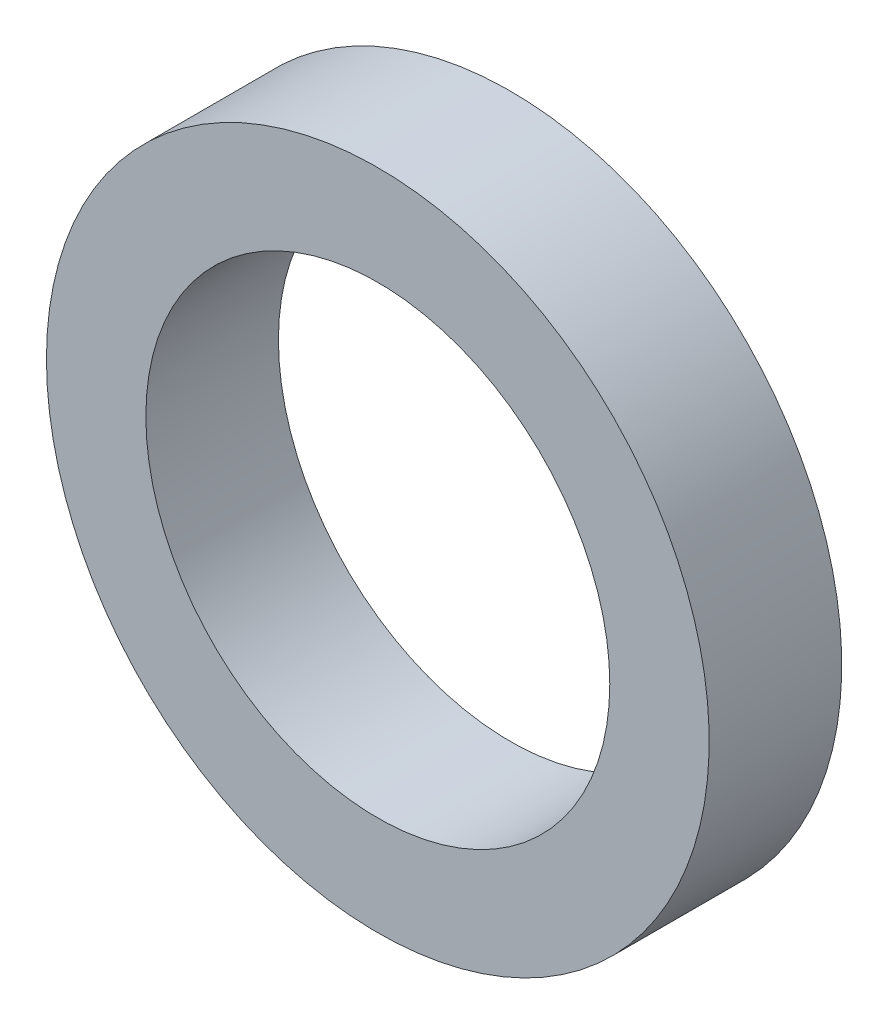
ISO-10303-21;
HEADER;
FILE_DESCRIPTION(('STEP AP214'),'2;1');
FILE_NAME('part.step','',(''),(''),'','','');
FILE_SCHEMA(('AUTOMOTIVE_DESIGN { 1 0 10303 214 1 1 1 1 }'));
ENDSEC;
DATA;
#1=APPLICATION_CONTEXT('core data for automotive mechanical design processes');
#2=APPLICATION_PROTOCOL_DEFINITION('international standard','automotive_design',2000,#1);
#3=PRODUCT_CONTEXT('',#1,'mechanical');
#4=PRODUCT('Part','Part','',(#3));
#5=PRODUCT_RELATED_PRODUCT_CATEGORY('part','',(#4));
#6=PRODUCT_DEFINITION_FORMATION('','',#4);
#7=PRODUCT_DEFINITION_CONTEXT('part definition',#1,'design');
#8=PRODUCT_DEFINITION('design','',#6,#7);
#9=PRODUCT_DEFINITION_SHAPE('','',#8);
#10=(LENGTH_UNIT() NAMED_UNIT(*) SI_UNIT(.MILLI.,.METRE.));
#11=(NAMED_UNIT(*) PLANE_ANGLE_UNIT() SI_UNIT($,.RADIAN.));
#12=(NAMED_UNIT(*) SI_UNIT($,.STERADIAN.) SOLID_ANGLE_UNIT());
#13=UNCERTAINTY_MEASURE_WITH_UNIT(LENGTH_MEASURE(1.E-05),#10,'distance_accuracy_value','');
#14=(GEOMETRIC_REPRESENTATION_CONTEXT(3) GLOBAL_UNCERTAINTY_ASSIGNED_CONTEXT((#13)) GLOBAL_UNIT_ASSIGNED_CONTEXT((#10,
#11,#12)) REPRESENTATION_CONTEXT('',''));
#15=CARTESIAN_POINT('',(0.,0.,0.));
#16=DIRECTION('',(0.,0.,1.));
#17=DIRECTION('',(1.,0.,0.));
#18=AXIS2_PLACEMENT_3D('',#15,#16,#17);
#19=CARTESIAN_POINT('',(0.,0.,1.5875));
#20=DIRECTION('',(0.,0.,-1.));
#21=DIRECTION('',(1.,0.,0.));
#22=AXIS2_PLACEMENT_3D('',#19,#20,#21);
#23=PLANE('',#22);
#24=CARTESIAN_POINT('',(0.,0.,1.5875));
#25=DIRECTION('',(0.,0.,-1.));
#26=DIRECTION('',(-1.,0.,0.));
#27=AXIS2_PLACEMENT_3D('',#24,#25,#26);
#28=CIRCLE('',#27,5.55625);
#29=CARTESIAN_POINT('',(-5.55625,0.,1.5875));
#30=VERTEX_POINT('',#29);
#31=EDGE_CURVE('E47',#30,#30,#28,.F.);
#32=ORIENTED_EDGE('',*,*,#31,.F.);
#33=EDGE_LOOP('',(#32));
#34=FACE_BOUND('',#33,.T.);
#35=CARTESIAN_POINT('',(0.,0.,1.5875));
#36=DIRECTION('',(0.,0.,-1.));
#37=DIRECTION('',(-1.,0.,0.));
#38=AXIS2_PLACEMENT_3D('',#35,#36,#37);
#39=CIRCLE('',#38,7.9375);
#40=CARTESIAN_POINT('',(-7.9375,0.,1.5875));
#41=VERTEX_POINT('',#40);
#42=EDGE_CURVE('E38',#41,#41,#39,.F.);
#43=ORIENTED_EDGE('',*,*,#42,.T.);
#44=EDGE_LOOP('',(#43));
#45=FACE_BOUND('',#44,.T.);
#46=ADVANCED_FACE('F35',(#34,#45),#23,.F.);
#47=CARTESIAN_POINT('',(0.,0.,-1.5875));
#48=DIRECTION('',(0.,0.,1.));
#49=DIRECTION('',(-1.,0.,0.));
#50=AXIS2_PLACEMENT_3D('',#47,#48,#49);
#51=CYLINDRICAL_SURFACE('',#50,7.9375);
#52=ORIENTED_EDGE('',*,*,#42,.F.);
#53=EDGE_LOOP('',(#52));
#54=FACE_BOUND('',#53,.T.);
#55=CARTESIAN_POINT('',(0.,0.,-1.5875));
#56=DIRECTION('',(0.,0.,-1.));
#57=DIRECTION('',(-1.,0.,0.));
#58=AXIS2_PLACEMENT_3D('',#55,#56,#57);
#59=CIRCLE('',#58,7.9375);
#60=CARTESIAN_POINT('',(-7.9375,0.,-1.5875));
#61=VERTEX_POINT('',#60);
#62=EDGE_CURVE('E42',#61,#61,#59,.F.);
#63=ORIENTED_EDGE('',*,*,#62,.T.);
#64=EDGE_LOOP('',(#63));
#65=FACE_BOUND('',#64,.T.);
#66=ADVANCED_FACE('F56',(#54,#65),#51,.T.);
#67=CARTESIAN_POINT('',(0.,0.,-1.5875));
#68=DIRECTION('',(0.,0.,1.));
#69=DIRECTION('',(-1.,0.,0.));
#70=AXIS2_PLACEMENT_3D('',#67,#68,#69);
#71=CYLINDRICAL_SURFACE('',#70,5.55625);
#72=CARTESIAN_POINT('',(0.,0.,-1.5875));
#73=DIRECTION('',(0.,0.,-1.));
#74=DIRECTION('',(-1.,0.,0.));
#75=AXIS2_PLACEMENT_3D('',#72,#73,#74);
#76=CIRCLE('',#75,5.55625);
#77=CARTESIAN_POINT('',(-5.55625,0.,-1.5875));
#78=VERTEX_POINT('',#77);
#79=EDGE_CURVE('E10',#78,#78,#76,.T.);
#80=ORIENTED_EDGE('',*,*,#79,.T.);
#81=EDGE_LOOP('',(#80));
#82=FACE_BOUND('',#81,.T.);
#83=ORIENTED_EDGE('',*,*,#31,.T.);
#84=EDGE_LOOP('',(#83));
#85=FACE_BOUND('',#84,.T.);
#86=ADVANCED_FACE('F59',(#82,#85),#71,.F.);
#87=CARTESIAN_POINT('',(0.,0.,-1.5875));
#88=DIRECTION('',(0.,0.,-1.));
#89=DIRECTION('',(1.,0.,0.));
#90=AXIS2_PLACEMENT_3D('',#87,#88,#89);
#91=PLANE('',#90);
#92=ORIENTED_EDGE('',*,*,#79,.F.);
#93=EDGE_LOOP('',(#92));
#94=FACE_BOUND('',#93,.T.);
#95=ORIENTED_EDGE('',*,*,#62,.F.);
#96=EDGE_LOOP('',(#95));
#97=FACE_BOUND('',#96,.T.);
#98=ADVANCED_FACE('F62',(#94,#97),#91,.T.);
#99=CLOSED_SHELL('',(#46,#66,#86,#98));
#100=MANIFOLD_SOLID_BREP('B2',#99);
#101=ADVANCED_BREP_SHAPE_REPRESENTATION('',(#18,#100),#14);
#102=SHAPE_DEFINITION_REPRESENTATION(#9,#101);
ENDSEC;
END-ISO-10303-21;
